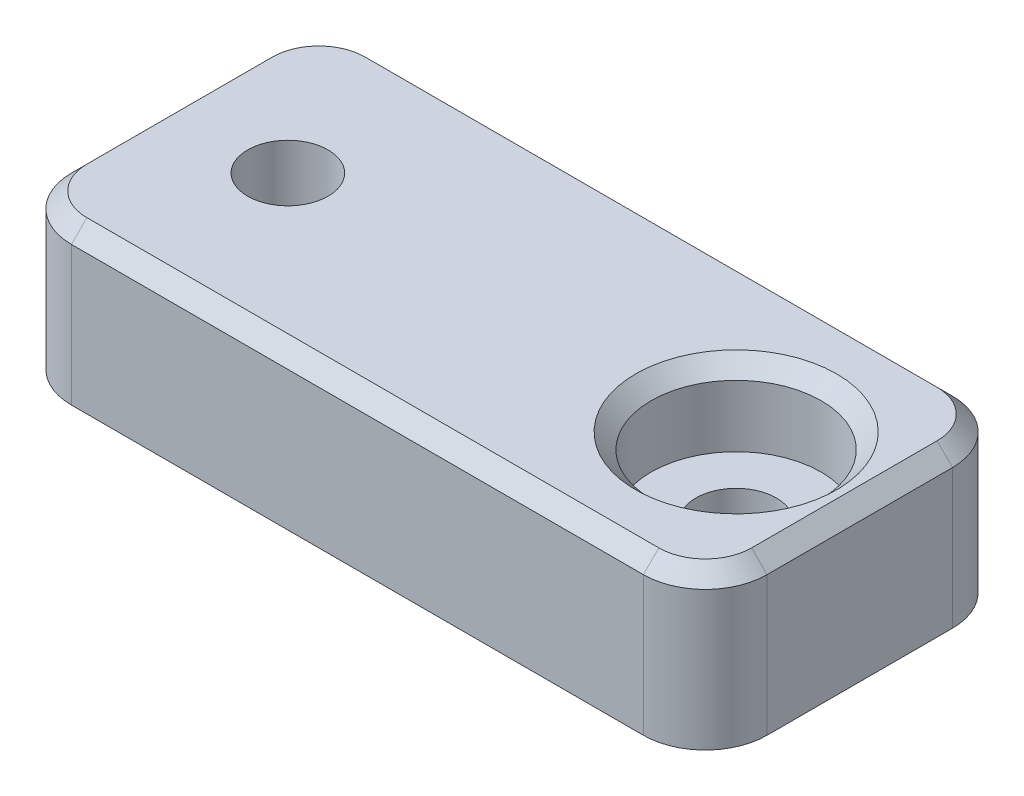
ISO-10303-21;
HEADER;
FILE_DESCRIPTION(('STEP AP214'),'2;1');
FILE_NAME('part.step','',(''),(''),'','','');
FILE_SCHEMA(('AUTOMOTIVE_DESIGN { 1 0 10303 214 1 1 1 1 }'));
ENDSEC;
DATA;
#1=APPLICATION_CONTEXT('core data for automotive mechanical design processes');
#2=APPLICATION_PROTOCOL_DEFINITION('international standard','automotive_design',2000,#1);
#3=PRODUCT_CONTEXT('',#1,'mechanical');
#4=PRODUCT('Part','Part','',(#3));
#5=PRODUCT_RELATED_PRODUCT_CATEGORY('part','',(#4));
#6=PRODUCT_DEFINITION_FORMATION('','',#4);
#7=PRODUCT_DEFINITION_CONTEXT('part definition',#1,'design');
#8=PRODUCT_DEFINITION('design','',#6,#7);
#9=PRODUCT_DEFINITION_SHAPE('','',#8);
#10=(LENGTH_UNIT() NAMED_UNIT(*) SI_UNIT(.MILLI.,.METRE.));
#11=(NAMED_UNIT(*) PLANE_ANGLE_UNIT() SI_UNIT($,.RADIAN.));
#12=(NAMED_UNIT(*) SI_UNIT($,.STERADIAN.) SOLID_ANGLE_UNIT());
#13=UNCERTAINTY_MEASURE_WITH_UNIT(LENGTH_MEASURE(1.E-05),#10,'distance_accuracy_value','');
#14=(GEOMETRIC_REPRESENTATION_CONTEXT(3) GLOBAL_UNCERTAINTY_ASSIGNED_CONTEXT((#13)) GLOBAL_UNIT_ASSIGNED_CONTEXT((#10,
#11,#12)) REPRESENTATION_CONTEXT('',''));
#15=CARTESIAN_POINT('',(0.,0.,0.));
#16=DIRECTION('',(0.,0.,1.));
#17=DIRECTION('',(1.,0.,0.));
#18=AXIS2_PLACEMENT_3D('',#15,#16,#17);
#19=CARTESIAN_POINT('',(14.5,-13.8539105243401,0.));
#20=DIRECTION('',(0.,1.,0.));
#21=DIRECTION('',(0.,0.,1.));
#22=AXIS2_PLACEMENT_3D('',#19,#20,#21);
#23=CYLINDRICAL_SURFACE('',#22,2.6);
#24=CARTESIAN_POINT('',(14.5,-5.,0.));
#25=DIRECTION('',(0.,-1.,0.));
#26=DIRECTION('',(0.,0.,-1.));
#27=AXIS2_PLACEMENT_3D('',#24,#25,#26);
#28=CIRCLE('',#27,2.6);
#29=CARTESIAN_POINT('',(14.5,-5.,-2.6));
#30=VERTEX_POINT('',#29);
#31=EDGE_CURVE('E188',#30,#30,#28,.F.);
#32=ORIENTED_EDGE('',*,*,#31,.F.);
#33=EDGE_LOOP('',(#32));
#34=FACE_BOUND('',#33,.T.);
#35=CARTESIAN_POINT('',(14.5,0.,0.));
#36=DIRECTION('',(0.,1.,0.));
#37=DIRECTION('',(0.,0.,1.));
#38=AXIS2_PLACEMENT_3D('',#35,#36,#37);
#39=CIRCLE('',#38,2.6);
#40=CARTESIAN_POINT('',(14.5,0.,2.6));
#41=VERTEX_POINT('',#40);
#42=EDGE_CURVE('E202',#41,#41,#39,.F.);
#43=ORIENTED_EDGE('',*,*,#42,.F.);
#44=EDGE_LOOP('',(#43));
#45=FACE_BOUND('',#44,.T.);
#46=ADVANCED_FACE('F32',(#34,#45),#23,.F.);
#47=CARTESIAN_POINT('',(22.5,-6.5,2.81876700471112));
#48=DIRECTION('',(0.,0.0871557427476546,-0.996194698091746));
#49=DIRECTION('',(0.,0.996194698091746,0.0871557427476546));
#50=AXIS2_PLACEMENT_3D('',#47,#48,#49);
#51=PLANE('',#50);
#52=DIRECTION('',(-0.705757556807953,0.705757556807951,0.0617457854184464));
#53=VECTOR('',#52,1.);
#54=CARTESIAN_POINT('',(6.94090559873747,-21.9409055987374,1.46786281024768));
#55=LINE('',#54,#53);
#56=CARTESIAN_POINT('',(-8.5,-6.5,2.81876700471112));
#57=VERTEX_POINT('',#56);
#58=CARTESIAN_POINT('',(-10.,-5.,2.95));
#59=VERTEX_POINT('',#58);
#60=EDGE_CURVE('E150',#57,#59,#55,.T.);
#61=ORIENTED_EDGE('',*,*,#60,.F.);
#62=DIRECTION('',(-1.,0.,0.));
#63=VECTOR('',#62,1.);
#64=CARTESIAN_POINT('',(22.5,-6.5,2.81876700471112));
#65=LINE('',#64,#63);
#66=CARTESIAN_POINT('',(8.5,-6.5,2.81876700471112));
#67=VERTEX_POINT('',#66);
#68=EDGE_CURVE('E166',#67,#57,#65,.T.);
#69=ORIENTED_EDGE('',*,*,#68,.F.);
#70=DIRECTION('',(-0.705757556807953,-0.705757556807951,-0.0617457854184464));
#71=VECTOR('',#70,1.);
#72=CARTESIAN_POINT('',(15.4733122058814,0.473312205881414,3.42885276995267));
#73=LINE('',#72,#71);
#74=CARTESIAN_POINT('',(10.,-5.,2.95));
#75=VERTEX_POINT('',#74);
#76=EDGE_CURVE('E191',#75,#67,#73,.T.);
#77=ORIENTED_EDGE('',*,*,#76,.F.);
#78=DIRECTION('',(-1.,0.,0.));
#79=VECTOR('',#78,1.);
#80=CARTESIAN_POINT('',(22.5,-5.,2.95));
#81=LINE('',#80,#79);
#82=EDGE_CURVE('E168',#75,#59,#81,.T.);
#83=ORIENTED_EDGE('',*,*,#82,.T.);
#84=EDGE_LOOP('',(#61,#69,#77,#83));
#85=FACE_BOUND('',#84,.T.);
#86=ADVANCED_FACE('F164',(#85),#51,.F.);
#87=CARTESIAN_POINT('',(22.5,-6.5,-2.81876700471112));
#88=DIRECTION('',(0.,1.,0.));
#89=DIRECTION('',(0.,0.,1.));
#90=AXIS2_PLACEMENT_3D('',#87,#88,#89);
#91=PLANE('',#90);
#92=DIRECTION('',(0.,0.,-1.));
#93=VECTOR('',#92,1.);
#94=CARTESIAN_POINT('',(-8.5,-6.5,-10.));
#95=LINE('',#94,#93);
#96=CARTESIAN_POINT('',(-8.5,-6.5,-2.81876700471112));
#97=VERTEX_POINT('',#96);
#98=EDGE_CURVE('E147',#57,#97,#95,.T.);
#99=ORIENTED_EDGE('',*,*,#98,.T.);
#100=DIRECTION('',(-1.,0.,0.));
#101=VECTOR('',#100,1.);
#102=CARTESIAN_POINT('',(22.5,-6.5,-2.81876700471112));
#103=LINE('',#102,#101);
#104=CARTESIAN_POINT('',(8.5,-6.5,-2.81876700471112));
#105=VERTEX_POINT('',#104);
#106=EDGE_CURVE('E174',#105,#97,#103,.T.);
#107=ORIENTED_EDGE('',*,*,#106,.F.);
#108=DIRECTION('',(0.,0.,1.));
#109=VECTOR('',#108,1.);
#110=CARTESIAN_POINT('',(8.5,-6.5,-10.));
#111=LINE('',#110,#109);
#112=EDGE_CURVE('E173',#105,#67,#111,.T.);
#113=ORIENTED_EDGE('',*,*,#112,.T.);
#114=ORIENTED_EDGE('',*,*,#68,.T.);
#115=EDGE_LOOP('',(#99,#107,#113,#114));
#116=FACE_BOUND('',#115,.T.);
#117=ADVANCED_FACE('F172',(#116),#91,.F.);
#118=CARTESIAN_POINT('',(22.5,-5.,-2.95));
#119=DIRECTION('',(0.,0.0871557427476546,0.996194698091746));
#120=DIRECTION('',(0.,-0.996194698091746,0.0871557427476546));
#121=AXIS2_PLACEMENT_3D('',#118,#119,#120);
#122=PLANE('',#121);
#123=DIRECTION('',(0.705757556807953,-0.705757556807951,0.0617457854184465));
#124=VECTOR('',#123,1.);
#125=CARTESIAN_POINT('',(6.18804619222476,-21.1880461922247,-1.53372947354639));
#126=LINE('',#125,#124);
#127=CARTESIAN_POINT('',(-10.,-5.,-2.95));
#128=VERTEX_POINT('',#127);
#129=EDGE_CURVE('E153',#128,#97,#126,.T.);
#130=ORIENTED_EDGE('',*,*,#129,.F.);
#131=DIRECTION('',(-1.,0.,0.));
#132=VECTOR('',#131,1.);
#133=CARTESIAN_POINT('',(22.5,-5.,-2.95));
#134=LINE('',#133,#132);
#135=CARTESIAN_POINT('',(10.,-5.,-2.95));
#136=VERTEX_POINT('',#135);
#137=EDGE_CURVE('E178',#136,#128,#134,.T.);
#138=ORIENTED_EDGE('',*,*,#137,.F.);
#139=DIRECTION('',(0.705757556807953,0.705757556807951,-0.0617457854184465));
#140=VECTOR('',#139,1.);
#141=CARTESIAN_POINT('',(16.2261716123941,1.22617161239412,-3.49471943325139));
#142=LINE('',#141,#140);
#143=EDGE_CURVE('E187',#105,#136,#142,.T.);
#144=ORIENTED_EDGE('',*,*,#143,.F.);
#145=ORIENTED_EDGE('',*,*,#106,.T.);
#146=EDGE_LOOP('',(#130,#138,#144,#145));
#147=FACE_BOUND('',#146,.T.);
#148=ADVANCED_FACE('F311',(#147),#122,.F.);
#149=CARTESIAN_POINT('',(-22.5,0.,0.));
#150=DIRECTION('',(-1.,0.,0.));
#151=DIRECTION('',(0.,0.,1.));
#152=AXIS2_PLACEMENT_3D('',#149,#150,#151);
#153=PLANE('',#152);
#154=DIRECTION('',(0.,-1.,0.));
#155=VECTOR('',#154,1.);
#156=CARTESIAN_POINT('',(-22.5,5.,6.));
#157=LINE('',#156,#155);
#158=CARTESIAN_POINT('',(-22.5,-5.,6.));
#159=VERTEX_POINT('',#158);
#160=CARTESIAN_POINT('',(-22.5,4.,6.));
#161=VERTEX_POINT('',#160);
#162=EDGE_CURVE('E223',#159,#161,#157,.F.);
#163=ORIENTED_EDGE('',*,*,#162,.T.);
#164=DIRECTION('',(0.,0.,-1.));
#165=VECTOR('',#164,1.);
#166=CARTESIAN_POINT('',(-22.5,3.99999999999999,-6.));
#167=LINE('',#166,#165);
#168=CARTESIAN_POINT('',(-22.5,3.99999999999999,-6.));
#169=VERTEX_POINT('',#168);
#170=EDGE_CURVE('E256',#161,#169,#167,.T.);
#171=ORIENTED_EDGE('',*,*,#170,.T.);
#172=DIRECTION('',(0.,1.,0.));
#173=VECTOR('',#172,1.);
#174=CARTESIAN_POINT('',(-22.5,-5.,-6.));
#175=LINE('',#174,#173);
#176=CARTESIAN_POINT('',(-22.5,-5.,-6.));
#177=VERTEX_POINT('',#176);
#178=EDGE_CURVE('E226',#169,#177,#175,.F.);
#179=ORIENTED_EDGE('',*,*,#178,.T.);
#180=DIRECTION('',(0.,0.,-1.));
#181=VECTOR('',#180,1.);
#182=CARTESIAN_POINT('',(-22.5,-5.,10.));
#183=LINE('',#182,#181);
#184=EDGE_CURVE('E299',#159,#177,#183,.T.);
#185=ORIENTED_EDGE('',*,*,#184,.F.);
#186=EDGE_LOOP('',(#163,#171,#179,#185));
#187=FACE_BOUND('',#186,.T.);
#188=ADVANCED_FACE('F343',(#187),#153,.T.);
#189=CARTESIAN_POINT('',(-14.5,-13.8539105243401,0.));
#190=DIRECTION('',(0.,1.,0.));
#191=DIRECTION('',(0.,0.,1.));
#192=AXIS2_PLACEMENT_3D('',#189,#190,#191);
#193=CYLINDRICAL_SURFACE('',#192,2.6);
#194=CARTESIAN_POINT('',(-14.5,5.,0.));
#195=DIRECTION('',(0.,1.,0.));
#196=DIRECTION('',(0.,0.,1.));
#197=AXIS2_PLACEMENT_3D('',#194,#195,#196);
#198=CIRCLE('',#197,2.6);
#199=CARTESIAN_POINT('',(-14.5,5.,2.6));
#200=VERTEX_POINT('',#199);
#201=EDGE_CURVE('E195',#200,#200,#198,.T.);
#202=ORIENTED_EDGE('',*,*,#201,.T.);
#203=EDGE_LOOP('',(#202));
#204=FACE_BOUND('',#203,.T.);
#205=CARTESIAN_POINT('',(-14.5,-5.,0.));
#206=DIRECTION('',(0.,-1.,0.));
#207=DIRECTION('',(0.,0.,-1.));
#208=AXIS2_PLACEMENT_3D('',#205,#206,#207);
#209=CIRCLE('',#208,2.6);
#210=CARTESIAN_POINT('',(-14.5,-5.,-2.6));
#211=VERTEX_POINT('',#210);
#212=EDGE_CURVE('E158',#211,#211,#209,.F.);
#213=ORIENTED_EDGE('',*,*,#212,.F.);
#214=EDGE_LOOP('',(#213));
#215=FACE_BOUND('',#214,.T.);
#216=ADVANCED_FACE('F339',(#204,#215),#193,.F.);
#217=CARTESIAN_POINT('',(22.5,0.,0.));
#218=DIRECTION('',(-1.,0.,0.));
#219=DIRECTION('',(0.,0.,1.));
#220=AXIS2_PLACEMENT_3D('',#217,#218,#219);
#221=PLANE('',#220);
#222=DIRECTION('',(0.,1.,0.));
#223=VECTOR('',#222,1.);
#224=CARTESIAN_POINT('',(22.5,0.,-6.));
#225=LINE('',#224,#223);
#226=CARTESIAN_POINT('',(22.5,-5.,-6.));
#227=VERTEX_POINT('',#226);
#228=CARTESIAN_POINT('',(22.5,3.99999999999999,-6.));
#229=VERTEX_POINT('',#228);
#230=EDGE_CURVE('E204',#227,#229,#225,.T.);
#231=ORIENTED_EDGE('',*,*,#230,.T.);
#232=DIRECTION('',(0.,0.,1.));
#233=VECTOR('',#232,1.);
#234=CARTESIAN_POINT('',(22.5,3.99999999999999,0.));
#235=LINE('',#234,#233);
#236=CARTESIAN_POINT('',(22.5,3.99999999999999,6.));
#237=VERTEX_POINT('',#236);
#238=EDGE_CURVE('E262',#229,#237,#235,.T.);
#239=ORIENTED_EDGE('',*,*,#238,.T.);
#240=DIRECTION('',(0.,-1.,0.));
#241=VECTOR('',#240,1.);
#242=CARTESIAN_POINT('',(22.5,0.,6.));
#243=LINE('',#242,#241);
#244=CARTESIAN_POINT('',(22.5,-5.,6.));
#245=VERTEX_POINT('',#244);
#246=EDGE_CURVE('E198',#237,#245,#243,.T.);
#247=ORIENTED_EDGE('',*,*,#246,.T.);
#248=DIRECTION('',(0.,0.,-1.));
#249=VECTOR('',#248,1.);
#250=CARTESIAN_POINT('',(22.5,-5.,-2.95));
#251=LINE('',#250,#249);
#252=EDGE_CURVE('E300',#245,#227,#251,.T.);
#253=ORIENTED_EDGE('',*,*,#252,.T.);
#254=EDGE_LOOP('',(#231,#239,#247,#253));
#255=FACE_BOUND('',#254,.T.);
#256=ADVANCED_FACE('F342',(#255),#221,.F.);
#257=CARTESIAN_POINT('',(22.5,5.,-10.));
#258=DIRECTION('',(0.,0.,1.));
#259=DIRECTION('',(1.,0.,0.));
#260=AXIS2_PLACEMENT_3D('',#257,#258,#259);
#261=PLANE('',#260);
#262=DIRECTION('',(0.,1.,0.));
#263=VECTOR('',#262,1.);
#264=CARTESIAN_POINT('',(-18.5,5.,-10.));
#265=LINE('',#264,#263);
#266=CARTESIAN_POINT('',(-18.5,-5.,-10.));
#267=VERTEX_POINT('',#266);
#268=CARTESIAN_POINT('',(-18.5,3.99999999999999,-10.));
#269=VERTEX_POINT('',#268);
#270=EDGE_CURVE('E206',#267,#269,#265,.T.);
#271=ORIENTED_EDGE('',*,*,#270,.T.);
#272=DIRECTION('',(1.,0.,0.));
#273=VECTOR('',#272,1.);
#274=CARTESIAN_POINT('',(22.5,3.99999999999999,-10.));
#275=LINE('',#274,#273);
#276=CARTESIAN_POINT('',(18.5,3.99999999999999,-10.));
#277=VERTEX_POINT('',#276);
#278=EDGE_CURVE('E49',#269,#277,#275,.T.);
#279=ORIENTED_EDGE('',*,*,#278,.T.);
#280=DIRECTION('',(0.,1.,0.));
#281=VECTOR('',#280,1.);
#282=CARTESIAN_POINT('',(18.5,5.,-10.));
#283=LINE('',#282,#281);
#284=CARTESIAN_POINT('',(18.5,-5.,-10.));
#285=VERTEX_POINT('',#284);
#286=EDGE_CURVE('E208',#277,#285,#283,.F.);
#287=ORIENTED_EDGE('',*,*,#286,.T.);
#288=DIRECTION('',(-1.,0.,0.));
#289=VECTOR('',#288,1.);
#290=CARTESIAN_POINT('',(22.5,-5.,-10.));
#291=LINE('',#290,#289);
#292=EDGE_CURVE('E184',#285,#267,#291,.T.);
#293=ORIENTED_EDGE('',*,*,#292,.T.);
#294=EDGE_LOOP('',(#271,#279,#287,#293));
#295=FACE_BOUND('',#294,.T.);
#296=ADVANCED_FACE('F347',(#295),#261,.F.);
#297=CARTESIAN_POINT('',(22.5,5.,10.));
#298=DIRECTION('',(0.,-1.,0.));
#299=DIRECTION('',(0.,0.,-1.));
#300=AXIS2_PLACEMENT_3D('',#297,#298,#299);
#301=PLANE('',#300);
#302=DIRECTION('',(0.,0.,1.));
#303=VECTOR('',#302,1.);
#304=CARTESIAN_POINT('',(-21.5,5.,6.));
#305=LINE('',#304,#303);
#306=CARTESIAN_POINT('',(-21.5,5.,-6.));
#307=VERTEX_POINT('',#306);
#308=CARTESIAN_POINT('',(-21.5,5.,6.));
#309=VERTEX_POINT('',#308);
#310=EDGE_CURVE('E244',#307,#309,#305,.T.);
#311=ORIENTED_EDGE('',*,*,#310,.T.);
#312=CARTESIAN_POINT('',(-18.5,5.,6.));
#313=DIRECTION('',(0.,-1.,0.));
#314=DIRECTION('',(0.,0.,-1.));
#315=AXIS2_PLACEMENT_3D('',#312,#313,#314);
#316=CIRCLE('',#315,3.);
#317=CARTESIAN_POINT('',(-18.5,5.,9.));
#318=VERTEX_POINT('',#317);
#319=EDGE_CURVE('E248',#309,#318,#316,.F.);
#320=ORIENTED_EDGE('',*,*,#319,.T.);
#321=DIRECTION('',(1.,0.,0.));
#322=VECTOR('',#321,1.);
#323=CARTESIAN_POINT('',(22.5,5.,9.));
#324=LINE('',#323,#322);
#325=CARTESIAN_POINT('',(18.5,5.,9.));
#326=VERTEX_POINT('',#325);
#327=EDGE_CURVE('E246',#318,#326,#324,.T.);
#328=ORIENTED_EDGE('',*,*,#327,.T.);
#329=CARTESIAN_POINT('',(18.5,5.,6.));
#330=DIRECTION('',(0.,-1.,0.));
#331=DIRECTION('',(0.,0.,-1.));
#332=AXIS2_PLACEMENT_3D('',#329,#330,#331);
#333=CIRCLE('',#332,3.);
#334=CARTESIAN_POINT('',(21.5,5.,6.));
#335=VERTEX_POINT('',#334);
#336=EDGE_CURVE('E242',#326,#335,#333,.F.);
#337=ORIENTED_EDGE('',*,*,#336,.T.);
#338=DIRECTION('',(0.,0.,-1.));
#339=VECTOR('',#338,1.);
#340=CARTESIAN_POINT('',(21.5,5.,10.));
#341=LINE('',#340,#339);
#342=CARTESIAN_POINT('',(21.5,5.,-6.));
#343=VERTEX_POINT('',#342);
#344=EDGE_CURVE('E238',#335,#343,#341,.T.);
#345=ORIENTED_EDGE('',*,*,#344,.T.);
#346=CARTESIAN_POINT('',(18.5,5.,-6.));
#347=DIRECTION('',(0.,-1.,0.));
#348=DIRECTION('',(0.,0.,-1.));
#349=AXIS2_PLACEMENT_3D('',#346,#347,#348);
#350=CIRCLE('',#349,3.);
#351=CARTESIAN_POINT('',(18.5,5.,-9.));
#352=VERTEX_POINT('',#351);
#353=EDGE_CURVE('E234',#343,#352,#350,.F.);
#354=ORIENTED_EDGE('',*,*,#353,.T.);
#355=DIRECTION('',(-1.,0.,0.));
#356=VECTOR('',#355,1.);
#357=CARTESIAN_POINT('',(22.5,5.,-9.));
#358=LINE('',#357,#356);
#359=CARTESIAN_POINT('',(-18.5,5.,-9.));
#360=VERTEX_POINT('',#359);
#361=EDGE_CURVE('E236',#352,#360,#358,.T.);
#362=ORIENTED_EDGE('',*,*,#361,.T.);
#363=CARTESIAN_POINT('',(-18.5,5.,-6.));
#364=DIRECTION('',(0.,-1.,0.));
#365=DIRECTION('',(0.,0.,-1.));
#366=AXIS2_PLACEMENT_3D('',#363,#364,#365);
#367=CIRCLE('',#366,3.);
#368=EDGE_CURVE('E240',#360,#307,#367,.F.);
#369=ORIENTED_EDGE('',*,*,#368,.T.);
#370=EDGE_LOOP('',(#311,#320,#328,#337,#345,#354,#362,#369));
#371=FACE_BOUND('',#370,.T.);
#372=CARTESIAN_POINT('',(14.5,5.,0.));
#373=DIRECTION('',(0.,-1.,0.));
#374=DIRECTION('',(0.,0.,-1.));
#375=AXIS2_PLACEMENT_3D('',#372,#373,#374);
#376=CIRCLE('',#375,6.5);
#377=CARTESIAN_POINT('',(14.5,5.,-6.5));
#378=VERTEX_POINT('',#377);
#379=EDGE_CURVE('E228',#378,#378,#376,.T.);
#380=ORIENTED_EDGE('',*,*,#379,.T.);
#381=EDGE_LOOP('',(#380));
#382=FACE_BOUND('',#381,.T.);
#383=ORIENTED_EDGE('',*,*,#201,.F.);
#384=EDGE_LOOP('',(#383));
#385=FACE_BOUND('',#384,.T.);
#386=ADVANCED_FACE('F358',(#371,#382,#385),#301,.F.);
#387=CARTESIAN_POINT('',(22.5,5.,10.));
#388=DIRECTION('',(0.,0.,-1.));
#389=DIRECTION('',(-1.,0.,0.));
#390=AXIS2_PLACEMENT_3D('',#387,#388,#389);
#391=PLANE('',#390);
#392=DIRECTION('',(0.,-1.,0.));
#393=VECTOR('',#392,1.);
#394=CARTESIAN_POINT('',(18.5,5.,10.));
#395=LINE('',#394,#393);
#396=CARTESIAN_POINT('',(18.5,-5.,10.));
#397=VERTEX_POINT('',#396);
#398=CARTESIAN_POINT('',(18.5,3.99999999999999,10.));
#399=VERTEX_POINT('',#398);
#400=EDGE_CURVE('E220',#397,#399,#395,.F.);
#401=ORIENTED_EDGE('',*,*,#400,.T.);
#402=DIRECTION('',(-1.,0.,0.));
#403=VECTOR('',#402,1.);
#404=CARTESIAN_POINT('',(22.5,3.99999999999999,10.));
#405=LINE('',#404,#403);
#406=CARTESIAN_POINT('',(-18.5,3.99999999999999,10.));
#407=VERTEX_POINT('',#406);
#408=EDGE_CURVE('E254',#399,#407,#405,.T.);
#409=ORIENTED_EDGE('',*,*,#408,.T.);
#410=DIRECTION('',(0.,-1.,0.));
#411=VECTOR('',#410,1.);
#412=CARTESIAN_POINT('',(-18.5,-5.,10.));
#413=LINE('',#412,#411);
#414=CARTESIAN_POINT('',(-18.5,-5.,10.));
#415=VERTEX_POINT('',#414);
#416=EDGE_CURVE('E218',#407,#415,#413,.T.);
#417=ORIENTED_EDGE('',*,*,#416,.T.);
#418=DIRECTION('',(-1.,0.,0.));
#419=VECTOR('',#418,1.);
#420=CARTESIAN_POINT('',(22.5,-5.,10.));
#421=LINE('',#420,#419);
#422=EDGE_CURVE('E176',#397,#415,#421,.T.);
#423=ORIENTED_EDGE('',*,*,#422,.F.);
#424=EDGE_LOOP('',(#401,#409,#417,#423));
#425=FACE_BOUND('',#424,.T.);
#426=ADVANCED_FACE('F322',(#425),#391,.F.);
#427=CARTESIAN_POINT('',(22.5,-5.,10.));
#428=DIRECTION('',(0.,1.,0.));
#429=DIRECTION('',(0.,0.,1.));
#430=AXIS2_PLACEMENT_3D('',#427,#428,#429);
#431=PLANE('',#430);
#432=ORIENTED_EDGE('',*,*,#292,.F.);
#433=CARTESIAN_POINT('',(18.5,-5.,-6.));
#434=DIRECTION('',(0.,1.,0.));
#435=DIRECTION('',(0.,0.,1.));
#436=AXIS2_PLACEMENT_3D('',#433,#434,#435);
#437=CIRCLE('',#436,4.);
#438=EDGE_CURVE('E216',#285,#227,#437,.F.);
#439=ORIENTED_EDGE('',*,*,#438,.T.);
#440=ORIENTED_EDGE('',*,*,#252,.F.);
#441=CARTESIAN_POINT('',(18.5,-5.,6.));
#442=DIRECTION('',(0.,1.,0.));
#443=DIRECTION('',(0.,0.,1.));
#444=AXIS2_PLACEMENT_3D('',#441,#442,#443);
#445=CIRCLE('',#444,4.);
#446=EDGE_CURVE('E214',#245,#397,#445,.F.);
#447=ORIENTED_EDGE('',*,*,#446,.T.);
#448=ORIENTED_EDGE('',*,*,#422,.T.);
#449=CARTESIAN_POINT('',(-18.5,-5.,6.));
#450=DIRECTION('',(0.,1.,0.));
#451=DIRECTION('',(0.,0.,1.));
#452=AXIS2_PLACEMENT_3D('',#449,#450,#451);
#453=CIRCLE('',#452,4.);
#454=EDGE_CURVE('E210',#415,#159,#453,.F.);
#455=ORIENTED_EDGE('',*,*,#454,.T.);
#456=ORIENTED_EDGE('',*,*,#184,.T.);
#457=CARTESIAN_POINT('',(-18.5,-5.,-6.));
#458=DIRECTION('',(0.,1.,0.));
#459=DIRECTION('',(0.,0.,1.));
#460=AXIS2_PLACEMENT_3D('',#457,#458,#459);
#461=CIRCLE('',#460,4.);
#462=EDGE_CURVE('E212',#177,#267,#461,.F.);
#463=ORIENTED_EDGE('',*,*,#462,.T.);
#464=EDGE_LOOP('',(#432,#439,#440,#447,#448,#455,#456,#463));
#465=FACE_BOUND('',#464,.T.);
#466=DIRECTION('',(0.,0.,1.));
#467=VECTOR('',#466,1.);
#468=CARTESIAN_POINT('',(-10.,-5.,10.));
#469=LINE('',#468,#467);
#470=EDGE_CURVE('E159',#128,#59,#469,.T.);
#471=ORIENTED_EDGE('',*,*,#470,.T.);
#472=ORIENTED_EDGE('',*,*,#82,.F.);
#473=DIRECTION('',(0.,0.,-1.));
#474=VECTOR('',#473,1.);
#475=CARTESIAN_POINT('',(10.,-5.,9.99999999999999));
#476=LINE('',#475,#474);
#477=EDGE_CURVE('E169',#75,#136,#476,.T.);
#478=ORIENTED_EDGE('',*,*,#477,.T.);
#479=ORIENTED_EDGE('',*,*,#137,.T.);
#480=EDGE_LOOP('',(#471,#472,#478,#479));
#481=FACE_BOUND('',#480,.T.);
#482=ORIENTED_EDGE('',*,*,#31,.T.);
#483=EDGE_LOOP('',(#482));
#484=FACE_BOUND('',#483,.T.);
#485=ORIENTED_EDGE('',*,*,#212,.T.);
#486=EDGE_LOOP('',(#485));
#487=FACE_BOUND('',#486,.T.);
#488=ADVANCED_FACE('F307',(#465,#481,#484,#487),#431,.F.);
#489=CARTESIAN_POINT('',(8.5,-6.5,-10.));
#490=DIRECTION('',(0.707106781186546,-0.707106781186549,0.));
#491=DIRECTION('',(0.707106781186549,0.707106781186546,0.));
#492=AXIS2_PLACEMENT_3D('',#489,#490,#491);
#493=PLANE('',#492);
#494=ORIENTED_EDGE('',*,*,#76,.T.);
#495=ORIENTED_EDGE('',*,*,#112,.F.);
#496=ORIENTED_EDGE('',*,*,#143,.T.);
#497=ORIENTED_EDGE('',*,*,#477,.F.);
#498=EDGE_LOOP('',(#494,#495,#496,#497));
#499=FACE_BOUND('',#498,.T.);
#500=ADVANCED_FACE('F313',(#499),#493,.T.);
#501=CARTESIAN_POINT('',(-8.5,-6.5,-10.));
#502=DIRECTION('',(-0.707106781186546,-0.707106781186549,0.));
#503=DIRECTION('',(0.707106781186549,-0.707106781186546,0.));
#504=AXIS2_PLACEMENT_3D('',#501,#502,#503);
#505=PLANE('',#504);
#506=ORIENTED_EDGE('',*,*,#60,.T.);
#507=ORIENTED_EDGE('',*,*,#470,.F.);
#508=ORIENTED_EDGE('',*,*,#129,.T.);
#509=ORIENTED_EDGE('',*,*,#98,.F.);
#510=EDGE_LOOP('',(#506,#507,#508,#509));
#511=FACE_BOUND('',#510,.T.);
#512=ADVANCED_FACE('F149',(#511),#505,.T.);
#513=CARTESIAN_POINT('',(18.5,0.,-6.));
#514=DIRECTION('',(0.,1.,0.));
#515=DIRECTION('',(0.,0.,1.));
#516=AXIS2_PLACEMENT_3D('',#513,#514,#515);
#517=CYLINDRICAL_SURFACE('',#516,4.);
#518=ORIENTED_EDGE('',*,*,#286,.F.);
#519=CARTESIAN_POINT('',(18.5,3.99999999999999,-6.));
#520=DIRECTION('',(0.,-1.,0.));
#521=DIRECTION('',(0.,0.,-1.));
#522=AXIS2_PLACEMENT_3D('',#519,#520,#521);
#523=CIRCLE('',#522,4.);
#524=EDGE_CURVE('E41',#277,#229,#523,.T.);
#525=ORIENTED_EDGE('',*,*,#524,.T.);
#526=ORIENTED_EDGE('',*,*,#230,.F.);
#527=ORIENTED_EDGE('',*,*,#438,.F.);
#528=EDGE_LOOP('',(#518,#525,#526,#527));
#529=FACE_BOUND('',#528,.T.);
#530=ADVANCED_FACE('F320',(#529),#517,.T.);
#531=CARTESIAN_POINT('',(18.5,0.,6.));
#532=DIRECTION('',(0.,-1.,0.));
#533=DIRECTION('',(0.,0.,-1.));
#534=AXIS2_PLACEMENT_3D('',#531,#532,#533);
#535=CYLINDRICAL_SURFACE('',#534,4.);
#536=ORIENTED_EDGE('',*,*,#246,.F.);
#537=CARTESIAN_POINT('',(18.5,3.99999999999999,6.));
#538=DIRECTION('',(0.,-1.,0.));
#539=DIRECTION('',(0.,0.,-1.));
#540=AXIS2_PLACEMENT_3D('',#537,#538,#539);
#541=CIRCLE('',#540,4.);
#542=EDGE_CURVE('E258',#237,#399,#541,.T.);
#543=ORIENTED_EDGE('',*,*,#542,.T.);
#544=ORIENTED_EDGE('',*,*,#400,.F.);
#545=ORIENTED_EDGE('',*,*,#446,.F.);
#546=EDGE_LOOP('',(#536,#543,#544,#545));
#547=FACE_BOUND('',#546,.T.);
#548=ADVANCED_FACE('F388',(#547),#535,.T.);
#549=CARTESIAN_POINT('',(-18.5,5.,-6.));
#550=DIRECTION('',(0.,-1.,0.));
#551=DIRECTION('',(0.,0.,-1.));
#552=AXIS2_PLACEMENT_3D('',#549,#550,#551);
#553=CYLINDRICAL_SURFACE('',#552,4.);
#554=ORIENTED_EDGE('',*,*,#178,.F.);
#555=CARTESIAN_POINT('',(-18.5,3.99999999999999,-6.));
#556=DIRECTION('',(0.,-1.,0.));
#557=DIRECTION('',(0.,0.,-1.));
#558=AXIS2_PLACEMENT_3D('',#555,#556,#557);
#559=CIRCLE('',#558,4.);
#560=EDGE_CURVE('E260',#169,#269,#559,.T.);
#561=ORIENTED_EDGE('',*,*,#560,.T.);
#562=ORIENTED_EDGE('',*,*,#270,.F.);
#563=ORIENTED_EDGE('',*,*,#462,.F.);
#564=EDGE_LOOP('',(#554,#561,#562,#563));
#565=FACE_BOUND('',#564,.T.);
#566=ADVANCED_FACE('F395',(#565),#553,.T.);
#567=CARTESIAN_POINT('',(-18.5,5.,6.));
#568=DIRECTION('',(0.,1.,0.));
#569=DIRECTION('',(0.,0.,1.));
#570=AXIS2_PLACEMENT_3D('',#567,#568,#569);
#571=CYLINDRICAL_SURFACE('',#570,4.);
#572=ORIENTED_EDGE('',*,*,#416,.F.);
#573=CARTESIAN_POINT('',(-18.5,3.99999999999999,6.));
#574=DIRECTION('',(0.,-1.,0.));
#575=DIRECTION('',(0.,0.,-1.));
#576=AXIS2_PLACEMENT_3D('',#573,#574,#575);
#577=CIRCLE('',#576,4.);
#578=EDGE_CURVE('E251',#407,#161,#577,.T.);
#579=ORIENTED_EDGE('',*,*,#578,.T.);
#580=ORIENTED_EDGE('',*,*,#162,.F.);
#581=ORIENTED_EDGE('',*,*,#454,.F.);
#582=EDGE_LOOP('',(#572,#579,#580,#581));
#583=FACE_BOUND('',#582,.T.);
#584=ADVANCED_FACE('F404',(#583),#571,.T.);
#585=CARTESIAN_POINT('',(14.5,0.,0.));
#586=DIRECTION('',(0.,1.,0.));
#587=DIRECTION('',(0.,0.,1.));
#588=AXIS2_PLACEMENT_3D('',#585,#586,#587);
#589=PLANE('',#588);
#590=CARTESIAN_POINT('',(14.5,0.,0.));
#591=DIRECTION('',(0.,1.,0.));
#592=DIRECTION('',(0.,0.,1.));
#593=AXIS2_PLACEMENT_3D('',#590,#591,#592);
#594=CIRCLE('',#593,5.5);
#595=CARTESIAN_POINT('',(14.5,0.,5.5));
#596=VERTEX_POINT('',#595);
#597=EDGE_CURVE('E231',#596,#596,#594,.T.);
#598=ORIENTED_EDGE('',*,*,#597,.T.);
#599=EDGE_LOOP('',(#598));
#600=FACE_BOUND('',#599,.T.);
#601=ORIENTED_EDGE('',*,*,#42,.T.);
#602=EDGE_LOOP('',(#601));
#603=FACE_BOUND('',#602,.T.);
#604=ADVANCED_FACE('F434',(#600,#603),#589,.T.);
#605=CARTESIAN_POINT('',(14.5,0.,0.));
#606=DIRECTION('',(0.,1.,0.));
#607=DIRECTION('',(0.,0.,1.));
#608=AXIS2_PLACEMENT_3D('',#605,#606,#607);
#609=CYLINDRICAL_SURFACE('',#608,5.5);
#610=CARTESIAN_POINT('',(14.5,4.,0.));
#611=DIRECTION('',(0.,-1.,0.));
#612=DIRECTION('',(0.,0.,-1.));
#613=AXIS2_PLACEMENT_3D('',#610,#611,#612);
#614=CIRCLE('',#613,5.5);
#615=CARTESIAN_POINT('',(14.5,4.,-5.5));
#616=VERTEX_POINT('',#615);
#617=EDGE_CURVE('E11',#616,#616,#614,.F.);
#618=ORIENTED_EDGE('',*,*,#617,.T.);
#619=EDGE_LOOP('',(#618));
#620=FACE_BOUND('',#619,.T.);
#621=ORIENTED_EDGE('',*,*,#597,.F.);
#622=EDGE_LOOP('',(#621));
#623=FACE_BOUND('',#622,.T.);
#624=ADVANCED_FACE('F337',(#620,#623),#609,.F.);
#625=CARTESIAN_POINT('',(18.5,5.,-6.));
#626=DIRECTION('',(0.,-1.,0.));
#627=DIRECTION('',(0.,0.,-1.));
#628=AXIS2_PLACEMENT_3D('',#625,#626,#627);
#629=CONICAL_SURFACE('',#628,3.,0.785398163397447);
#630=DIRECTION('',(-0.707106781186546,0.707106781186549,0.));
#631=VECTOR('',#630,1.);
#632=CARTESIAN_POINT('',(22.5,3.99999999999999,-6.));
#633=LINE('',#632,#631);
#634=EDGE_CURVE('E281',#229,#343,#633,.T.);
#635=ORIENTED_EDGE('',*,*,#634,.F.);
#636=ORIENTED_EDGE('',*,*,#524,.F.);
#637=DIRECTION('',(0.,-0.707106781186549,-0.707106781186546));
#638=VECTOR('',#637,1.);
#639=CARTESIAN_POINT('',(18.5,5.,-9.));
#640=LINE('',#639,#638);
#641=EDGE_CURVE('E36',#352,#277,#640,.T.);
#642=ORIENTED_EDGE('',*,*,#641,.F.);
#643=ORIENTED_EDGE('',*,*,#353,.F.);
#644=EDGE_LOOP('',(#635,#636,#642,#643));
#645=FACE_BOUND('',#644,.T.);
#646=ADVANCED_FACE('F381',(#645),#629,.T.);
#647=CARTESIAN_POINT('',(22.5,5.,-9.));
#648=DIRECTION('',(0.,-0.707106781186547,0.707106781186548));
#649=DIRECTION('',(-1.,0.,0.));
#650=AXIS2_PLACEMENT_3D('',#647,#648,#649);
#651=PLANE('',#650);
#652=ORIENTED_EDGE('',*,*,#641,.T.);
#653=ORIENTED_EDGE('',*,*,#278,.F.);
#654=DIRECTION('',(0.,-0.707106781186548,-0.707106781186547));
#655=VECTOR('',#654,1.);
#656=CARTESIAN_POINT('',(-18.5,5.,-9.));
#657=LINE('',#656,#655);
#658=EDGE_CURVE('E279',#360,#269,#657,.T.);
#659=ORIENTED_EDGE('',*,*,#658,.F.);
#660=ORIENTED_EDGE('',*,*,#361,.F.);
#661=EDGE_LOOP('',(#652,#653,#659,#660));
#662=FACE_BOUND('',#661,.T.);
#663=ADVANCED_FACE('F370',(#662),#651,.F.);
#664=CARTESIAN_POINT('',(22.5,3.99999999999999,0.));
#665=DIRECTION('',(-0.707106781186549,-0.707106781186546,0.));
#666=DIRECTION('',(0.,0.,1.));
#667=AXIS2_PLACEMENT_3D('',#664,#665,#666);
#668=PLANE('',#667);
#669=ORIENTED_EDGE('',*,*,#634,.T.);
#670=ORIENTED_EDGE('',*,*,#344,.F.);
#671=DIRECTION('',(-0.707106781186546,0.707106781186549,0.));
#672=VECTOR('',#671,1.);
#673=CARTESIAN_POINT('',(22.5,3.99999999999999,6.));
#674=LINE('',#673,#672);
#675=EDGE_CURVE('E276',#237,#335,#674,.T.);
#676=ORIENTED_EDGE('',*,*,#675,.F.);
#677=ORIENTED_EDGE('',*,*,#238,.F.);
#678=EDGE_LOOP('',(#669,#670,#676,#677));
#679=FACE_BOUND('',#678,.T.);
#680=ADVANCED_FACE('F383',(#679),#668,.F.);
#681=CARTESIAN_POINT('',(-18.5,5.,-6.));
#682=DIRECTION('',(0.,-1.,0.));
#683=DIRECTION('',(0.,0.,-1.));
#684=AXIS2_PLACEMENT_3D('',#681,#682,#683);
#685=CONICAL_SURFACE('',#684,3.,0.785398163397446);
#686=ORIENTED_EDGE('',*,*,#658,.T.);
#687=ORIENTED_EDGE('',*,*,#560,.F.);
#688=DIRECTION('',(-0.707106781186546,-0.707106781186549,0.));
#689=VECTOR('',#688,1.);
#690=CARTESIAN_POINT('',(-21.5,5.,-6.));
#691=LINE('',#690,#689);
#692=EDGE_CURVE('E273',#307,#169,#691,.T.);
#693=ORIENTED_EDGE('',*,*,#692,.F.);
#694=ORIENTED_EDGE('',*,*,#368,.F.);
#695=EDGE_LOOP('',(#686,#687,#693,#694));
#696=FACE_BOUND('',#695,.T.);
#697=ADVANCED_FACE('F374',(#696),#685,.T.);
#698=CARTESIAN_POINT('',(18.5,5.,6.));
#699=DIRECTION('',(0.,-1.,0.));
#700=DIRECTION('',(0.,0.,-1.));
#701=AXIS2_PLACEMENT_3D('',#698,#699,#700);
#702=CONICAL_SURFACE('',#701,3.,0.785398163397446);
#703=ORIENTED_EDGE('',*,*,#675,.T.);
#704=ORIENTED_EDGE('',*,*,#336,.F.);
#705=DIRECTION('',(0.,0.707106781186549,-0.707106781186546));
#706=VECTOR('',#705,1.);
#707=CARTESIAN_POINT('',(18.5,3.99999999999999,10.));
#708=LINE('',#707,#706);
#709=EDGE_CURVE('E270',#399,#326,#708,.T.);
#710=ORIENTED_EDGE('',*,*,#709,.F.);
#711=ORIENTED_EDGE('',*,*,#542,.F.);
#712=EDGE_LOOP('',(#703,#704,#710,#711));
#713=FACE_BOUND('',#712,.T.);
#714=ADVANCED_FACE('F416',(#713),#702,.T.);
#715=CARTESIAN_POINT('',(-21.5,5.,10.));
#716=DIRECTION('',(-0.707106781186549,0.707106781186546,0.));
#717=DIRECTION('',(0.,0.,-1.));
#718=AXIS2_PLACEMENT_3D('',#715,#716,#717);
#719=PLANE('',#718);
#720=ORIENTED_EDGE('',*,*,#692,.T.);
#721=ORIENTED_EDGE('',*,*,#170,.F.);
#722=DIRECTION('',(-0.707106781186546,-0.707106781186549,0.));
#723=VECTOR('',#722,1.);
#724=CARTESIAN_POINT('',(-21.5,5.,6.));
#725=LINE('',#724,#723);
#726=EDGE_CURVE('E268',#309,#161,#725,.T.);
#727=ORIENTED_EDGE('',*,*,#726,.F.);
#728=ORIENTED_EDGE('',*,*,#310,.F.);
#729=EDGE_LOOP('',(#720,#721,#727,#728));
#730=FACE_BOUND('',#729,.T.);
#731=ADVANCED_FACE('F399',(#730),#719,.T.);
#732=CARTESIAN_POINT('',(22.5,3.99999999999999,10.));
#733=DIRECTION('',(0.,-0.707106781186546,-0.707106781186549));
#734=DIRECTION('',(-1.,0.,0.));
#735=AXIS2_PLACEMENT_3D('',#732,#733,#734);
#736=PLANE('',#735);
#737=ORIENTED_EDGE('',*,*,#709,.T.);
#738=ORIENTED_EDGE('',*,*,#327,.F.);
#739=DIRECTION('',(0.,0.707106781186549,-0.707106781186546));
#740=VECTOR('',#739,1.);
#741=CARTESIAN_POINT('',(-18.5,3.99999999999999,10.));
#742=LINE('',#741,#740);
#743=EDGE_CURVE('E266',#407,#318,#742,.T.);
#744=ORIENTED_EDGE('',*,*,#743,.F.);
#745=ORIENTED_EDGE('',*,*,#408,.F.);
#746=EDGE_LOOP('',(#737,#738,#744,#745));
#747=FACE_BOUND('',#746,.T.);
#748=ADVANCED_FACE('F412',(#747),#736,.F.);
#749=CARTESIAN_POINT('',(-18.5,5.,6.));
#750=DIRECTION('',(0.,-1.,0.));
#751=DIRECTION('',(0.,0.,-1.));
#752=AXIS2_PLACEMENT_3D('',#749,#750,#751);
#753=CONICAL_SURFACE('',#752,3.,0.785398163397447);
#754=ORIENTED_EDGE('',*,*,#726,.T.);
#755=ORIENTED_EDGE('',*,*,#578,.F.);
#756=ORIENTED_EDGE('',*,*,#743,.T.);
#757=ORIENTED_EDGE('',*,*,#319,.F.);
#758=EDGE_LOOP('',(#754,#755,#756,#757));
#759=FACE_BOUND('',#758,.T.);
#760=ADVANCED_FACE('F408',(#759),#753,.T.);
#761=CARTESIAN_POINT('',(14.5,4.,0.));
#762=DIRECTION('',(0.,1.,0.));
#763=DIRECTION('',(0.,0.,1.));
#764=AXIS2_PLACEMENT_3D('',#761,#762,#763);
#765=CONICAL_SURFACE('',#764,5.5,0.785398163397449);
#766=ORIENTED_EDGE('',*,*,#379,.F.);
#767=EDGE_LOOP('',(#766));
#768=FACE_BOUND('',#767,.T.);
#769=ORIENTED_EDGE('',*,*,#617,.F.);
#770=EDGE_LOOP('',(#769));
#771=FACE_BOUND('',#770,.T.);
#772=ADVANCED_FACE('F34',(#768,#771),#765,.F.);
#773=CLOSED_SHELL('',(#46,#86,#117,#148,#188,#216,#256,#296,#386,#426,#488,#500,#512,#530,#548,
#566,#584,#604,#624,#646,#663,#680,#697,#714,#731,#748,#760,#772));
#774=MANIFOLD_SOLID_BREP('B2',#773);
#775=ADVANCED_BREP_SHAPE_REPRESENTATION('',(#18,#774),#14);
#776=SHAPE_DEFINITION_REPRESENTATION(#9,#775);
ENDSEC;
END-ISO-10303-21;
